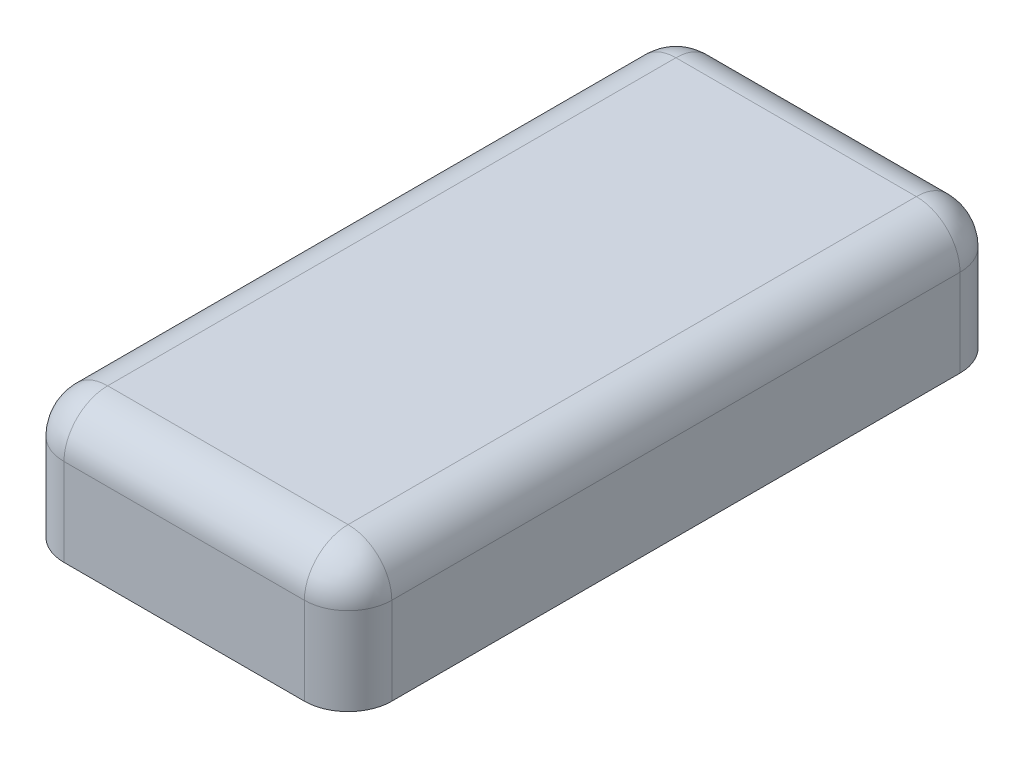
ISO-10303-21;
HEADER;
FILE_DESCRIPTION(('STEP AP214'),'2;1');
FILE_NAME('part.step','',(''),(''),'','','');
FILE_SCHEMA(('AUTOMOTIVE_DESIGN { 1 0 10303 214 1 1 1 1 }'));
ENDSEC;
DATA;
#1=APPLICATION_CONTEXT('core data for automotive mechanical design processes');
#2=APPLICATION_PROTOCOL_DEFINITION('international standard','automotive_design',2000,#1);
#3=PRODUCT_CONTEXT('',#1,'mechanical');
#4=PRODUCT('Part','Part','',(#3));
#5=PRODUCT_RELATED_PRODUCT_CATEGORY('part','',(#4));
#6=PRODUCT_DEFINITION_FORMATION('','',#4);
#7=PRODUCT_DEFINITION_CONTEXT('part definition',#1,'design');
#8=PRODUCT_DEFINITION('design','',#6,#7);
#9=PRODUCT_DEFINITION_SHAPE('','',#8);
#10=(LENGTH_UNIT() NAMED_UNIT(*) SI_UNIT(.MILLI.,.METRE.));
#11=(NAMED_UNIT(*) PLANE_ANGLE_UNIT() SI_UNIT($,.RADIAN.));
#12=(NAMED_UNIT(*) SI_UNIT($,.STERADIAN.) SOLID_ANGLE_UNIT());
#13=UNCERTAINTY_MEASURE_WITH_UNIT(LENGTH_MEASURE(1.E-05),#10,'distance_accuracy_value','');
#14=(GEOMETRIC_REPRESENTATION_CONTEXT(3) GLOBAL_UNCERTAINTY_ASSIGNED_CONTEXT((#13)) GLOBAL_UNIT_ASSIGNED_CONTEXT((#10,
#11,#12)) REPRESENTATION_CONTEXT('',''));
#15=CARTESIAN_POINT('',(0.,0.,0.));
#16=DIRECTION('',(0.,0.,1.));
#17=DIRECTION('',(1.,0.,0.));
#18=AXIS2_PLACEMENT_3D('',#15,#16,#17);
#19=CARTESIAN_POINT('',(0.75,0.6,-1.5));
#20=DIRECTION('',(-1.,0.,0.));
#21=DIRECTION('',(0.,0.,1.));
#22=AXIS2_PLACEMENT_3D('',#19,#20,#21);
#23=PLANE('',#22);
#24=DIRECTION('',(0.,-1.,0.));
#25=VECTOR('',#24,1.);
#26=CARTESIAN_POINT('',(0.75,0.6,-1.3));
#27=LINE('',#26,#25);
#28=CARTESIAN_POINT('',(0.75,0.,-1.3));
#29=VERTEX_POINT('',#28);
#30=CARTESIAN_POINT('',(0.75,0.4,-1.3));
#31=VERTEX_POINT('',#30);
#32=EDGE_CURVE('E120',#29,#31,#27,.F.);
#33=ORIENTED_EDGE('',*,*,#32,.T.);
#34=DIRECTION('',(0.,0.,-1.));
#35=VECTOR('',#34,1.);
#36=CARTESIAN_POINT('',(0.75,0.4,1.3));
#37=LINE('',#36,#35);
#38=CARTESIAN_POINT('',(0.75,0.4,1.3));
#39=VERTEX_POINT('',#38);
#40=EDGE_CURVE('E60',#31,#39,#37,.F.);
#41=ORIENTED_EDGE('',*,*,#40,.T.);
#42=DIRECTION('',(0.,-1.,0.));
#43=VECTOR('',#42,1.);
#44=CARTESIAN_POINT('',(0.75,0.6,1.3));
#45=LINE('',#44,#43);
#46=CARTESIAN_POINT('',(0.75,0.,1.3));
#47=VERTEX_POINT('',#46);
#48=EDGE_CURVE('E113',#39,#47,#45,.T.);
#49=ORIENTED_EDGE('',*,*,#48,.T.);
#50=DIRECTION('',(0.,0.,-1.));
#51=VECTOR('',#50,1.);
#52=CARTESIAN_POINT('',(0.75,0.,-1.5));
#53=LINE('',#52,#51);
#54=EDGE_CURVE('E116',#47,#29,#53,.T.);
#55=ORIENTED_EDGE('',*,*,#54,.T.);
#56=EDGE_LOOP('',(#33,#41,#49,#55));
#57=FACE_BOUND('',#56,.T.);
#58=ADVANCED_FACE('F36',(#57),#23,.F.);
#59=CARTESIAN_POINT('',(-0.75,0.6,-1.5));
#60=DIRECTION('',(0.,0.,1.));
#61=DIRECTION('',(1.,0.,0.));
#62=AXIS2_PLACEMENT_3D('',#59,#60,#61);
#63=PLANE('',#62);
#64=DIRECTION('',(0.,-1.,0.));
#65=VECTOR('',#64,1.);
#66=CARTESIAN_POINT('',(-0.55,0.6,-1.5));
#67=LINE('',#66,#65);
#68=CARTESIAN_POINT('',(-0.55,0.,-1.5));
#69=VERTEX_POINT('',#68);
#70=CARTESIAN_POINT('',(-0.55,0.4,-1.5));
#71=VERTEX_POINT('',#70);
#72=EDGE_CURVE('E153',#69,#71,#67,.F.);
#73=ORIENTED_EDGE('',*,*,#72,.T.);
#74=DIRECTION('',(-1.,0.,0.));
#75=VECTOR('',#74,1.);
#76=CARTESIAN_POINT('',(0.55,0.4,-1.5));
#77=LINE('',#76,#75);
#78=CARTESIAN_POINT('',(0.55,0.4,-1.5));
#79=VERTEX_POINT('',#78);
#80=EDGE_CURVE('E179',#71,#79,#77,.F.);
#81=ORIENTED_EDGE('',*,*,#80,.T.);
#82=DIRECTION('',(0.,-1.,0.));
#83=VECTOR('',#82,1.);
#84=CARTESIAN_POINT('',(0.55,0.6,-1.5));
#85=LINE('',#84,#83);
#86=CARTESIAN_POINT('',(0.55,0.,-1.5));
#87=VERTEX_POINT('',#86);
#88=EDGE_CURVE('E156',#79,#87,#85,.T.);
#89=ORIENTED_EDGE('',*,*,#88,.T.);
#90=DIRECTION('',(-1.,0.,0.));
#91=VECTOR('',#90,1.);
#92=CARTESIAN_POINT('',(-0.75,0.,-1.5));
#93=LINE('',#92,#91);
#94=EDGE_CURVE('E134',#87,#69,#93,.T.);
#95=ORIENTED_EDGE('',*,*,#94,.T.);
#96=EDGE_LOOP('',(#73,#81,#89,#95));
#97=FACE_BOUND('',#96,.T.);
#98=ADVANCED_FACE('F238',(#97),#63,.F.);
#99=CARTESIAN_POINT('',(-0.75,0.6,-1.5));
#100=DIRECTION('',(1.,0.,0.));
#101=DIRECTION('',(0.,0.,-1.));
#102=AXIS2_PLACEMENT_3D('',#99,#100,#101);
#103=PLANE('',#102);
#104=DIRECTION('',(0.,-1.,0.));
#105=VECTOR('',#104,1.);
#106=CARTESIAN_POINT('',(-0.75,0.6,1.3));
#107=LINE('',#106,#105);
#108=CARTESIAN_POINT('',(-0.75,0.,1.3));
#109=VERTEX_POINT('',#108);
#110=CARTESIAN_POINT('',(-0.75,0.4,1.3));
#111=VERTEX_POINT('',#110);
#112=EDGE_CURVE('E160',#109,#111,#107,.F.);
#113=ORIENTED_EDGE('',*,*,#112,.T.);
#114=DIRECTION('',(0.,0.,1.));
#115=VECTOR('',#114,1.);
#116=CARTESIAN_POINT('',(-0.75,0.4,-1.3));
#117=LINE('',#116,#115);
#118=CARTESIAN_POINT('',(-0.75,0.4,-1.3));
#119=VERTEX_POINT('',#118);
#120=EDGE_CURVE('E175',#111,#119,#117,.F.);
#121=ORIENTED_EDGE('',*,*,#120,.T.);
#122=DIRECTION('',(0.,-1.,0.));
#123=VECTOR('',#122,1.);
#124=CARTESIAN_POINT('',(-0.75,0.6,-1.3));
#125=LINE('',#124,#123);
#126=CARTESIAN_POINT('',(-0.75,0.,-1.3));
#127=VERTEX_POINT('',#126);
#128=EDGE_CURVE('E158',#119,#127,#125,.T.);
#129=ORIENTED_EDGE('',*,*,#128,.T.);
#130=DIRECTION('',(0.,0.,1.));
#131=VECTOR('',#130,1.);
#132=CARTESIAN_POINT('',(-0.75,0.,-1.5));
#133=LINE('',#132,#131);
#134=EDGE_CURVE('E137',#127,#109,#133,.T.);
#135=ORIENTED_EDGE('',*,*,#134,.T.);
#136=EDGE_LOOP('',(#113,#121,#129,#135));
#137=FACE_BOUND('',#136,.T.);
#138=ADVANCED_FACE('F243',(#137),#103,.F.);
#139=CARTESIAN_POINT('',(-0.75,0.6,1.5));
#140=DIRECTION('',(0.,0.,-1.));
#141=DIRECTION('',(-1.,0.,0.));
#142=AXIS2_PLACEMENT_3D('',#139,#140,#141);
#143=PLANE('',#142);
#144=DIRECTION('',(0.,-1.,0.));
#145=VECTOR('',#144,1.);
#146=CARTESIAN_POINT('',(0.55,0.6,1.5));
#147=LINE('',#146,#145);
#148=CARTESIAN_POINT('',(0.55,0.,1.5));
#149=VERTEX_POINT('',#148);
#150=CARTESIAN_POINT('',(0.55,0.4,1.5));
#151=VERTEX_POINT('',#150);
#152=EDGE_CURVE('E124',#149,#151,#147,.F.);
#153=ORIENTED_EDGE('',*,*,#152,.T.);
#154=DIRECTION('',(1.,0.,0.));
#155=VECTOR('',#154,1.);
#156=CARTESIAN_POINT('',(-0.55,0.4,1.5));
#157=LINE('',#156,#155);
#158=CARTESIAN_POINT('',(-0.55,0.4,1.5));
#159=VERTEX_POINT('',#158);
#160=EDGE_CURVE('E11',#151,#159,#157,.F.);
#161=ORIENTED_EDGE('',*,*,#160,.T.);
#162=DIRECTION('',(0.,-1.,0.));
#163=VECTOR('',#162,1.);
#164=CARTESIAN_POINT('',(-0.55,0.6,1.5));
#165=LINE('',#164,#163);
#166=CARTESIAN_POINT('',(-0.55,0.,1.5));
#167=VERTEX_POINT('',#166);
#168=EDGE_CURVE('E128',#159,#167,#165,.T.);
#169=ORIENTED_EDGE('',*,*,#168,.T.);
#170=DIRECTION('',(1.,0.,0.));
#171=VECTOR('',#170,1.);
#172=CARTESIAN_POINT('',(-0.75,0.,1.5));
#173=LINE('',#172,#171);
#174=EDGE_CURVE('E144',#167,#149,#173,.T.);
#175=ORIENTED_EDGE('',*,*,#174,.T.);
#176=EDGE_LOOP('',(#153,#161,#169,#175));
#177=FACE_BOUND('',#176,.T.);
#178=ADVANCED_FACE('F354',(#177),#143,.F.);
#179=CARTESIAN_POINT('',(0.,0.6,0.));
#180=DIRECTION('',(0.,1.,0.));
#181=DIRECTION('',(0.,0.,1.));
#182=AXIS2_PLACEMENT_3D('',#179,#180,#181);
#183=PLANE('',#182);
#184=DIRECTION('',(-1.,0.,0.));
#185=VECTOR('',#184,1.);
#186=CARTESIAN_POINT('',(-0.55,0.6,-1.3));
#187=LINE('',#186,#185);
#188=CARTESIAN_POINT('',(0.55,0.6,-1.3));
#189=VERTEX_POINT('',#188);
#190=CARTESIAN_POINT('',(-0.55,0.6,-1.3));
#191=VERTEX_POINT('',#190);
#192=EDGE_CURVE('E170',#189,#191,#187,.T.);
#193=ORIENTED_EDGE('',*,*,#192,.T.);
#194=DIRECTION('',(0.,0.,1.));
#195=VECTOR('',#194,1.);
#196=CARTESIAN_POINT('',(-0.55,0.6,1.3));
#197=LINE('',#196,#195);
#198=CARTESIAN_POINT('',(-0.55,0.6,1.3));
#199=VERTEX_POINT('',#198);
#200=EDGE_CURVE('E172',#191,#199,#197,.T.);
#201=ORIENTED_EDGE('',*,*,#200,.T.);
#202=DIRECTION('',(1.,0.,0.));
#203=VECTOR('',#202,1.);
#204=CARTESIAN_POINT('',(0.55,0.6,1.3));
#205=LINE('',#204,#203);
#206=CARTESIAN_POINT('',(0.55,0.6,1.3));
#207=VERTEX_POINT('',#206);
#208=EDGE_CURVE('E166',#199,#207,#205,.T.);
#209=ORIENTED_EDGE('',*,*,#208,.T.);
#210=DIRECTION('',(0.,0.,-1.));
#211=VECTOR('',#210,1.);
#212=CARTESIAN_POINT('',(0.55,0.6,-1.3));
#213=LINE('',#212,#211);
#214=EDGE_CURVE('E168',#207,#189,#213,.T.);
#215=ORIENTED_EDGE('',*,*,#214,.T.);
#216=EDGE_LOOP('',(#193,#201,#209,#215));
#217=FACE_BOUND('',#216,.T.);
#218=ADVANCED_FACE('F215',(#217),#183,.T.);
#219=CARTESIAN_POINT('',(0.,0.,0.));
#220=DIRECTION('',(0.,1.,0.));
#221=DIRECTION('',(0.,0.,1.));
#222=AXIS2_PLACEMENT_3D('',#219,#220,#221);
#223=PLANE('',#222);
#224=ORIENTED_EDGE('',*,*,#54,.F.);
#225=CARTESIAN_POINT('',(0.55,0.,1.3));
#226=DIRECTION('',(0.,1.,0.));
#227=DIRECTION('',(0.,0.,1.));
#228=AXIS2_PLACEMENT_3D('',#225,#226,#227);
#229=CIRCLE('',#228,0.2);
#230=EDGE_CURVE('E122',#47,#149,#229,.F.);
#231=ORIENTED_EDGE('',*,*,#230,.T.);
#232=ORIENTED_EDGE('',*,*,#174,.F.);
#233=CARTESIAN_POINT('',(-0.55,0.,1.3));
#234=DIRECTION('',(0.,1.,0.));
#235=DIRECTION('',(0.,0.,1.));
#236=AXIS2_PLACEMENT_3D('',#233,#234,#235);
#237=CIRCLE('',#236,0.2);
#238=EDGE_CURVE('E148',#167,#109,#237,.F.);
#239=ORIENTED_EDGE('',*,*,#238,.T.);
#240=ORIENTED_EDGE('',*,*,#134,.F.);
#241=CARTESIAN_POINT('',(-0.55,0.,-1.3));
#242=DIRECTION('',(0.,1.,0.));
#243=DIRECTION('',(0.,0.,1.));
#244=AXIS2_PLACEMENT_3D('',#241,#242,#243);
#245=CIRCLE('',#244,0.2);
#246=EDGE_CURVE('E119',#127,#69,#245,.F.);
#247=ORIENTED_EDGE('',*,*,#246,.T.);
#248=ORIENTED_EDGE('',*,*,#94,.F.);
#249=CARTESIAN_POINT('',(0.55,0.,-1.3));
#250=DIRECTION('',(0.,1.,0.));
#251=DIRECTION('',(0.,0.,1.));
#252=AXIS2_PLACEMENT_3D('',#249,#250,#251);
#253=CIRCLE('',#252,0.2);
#254=EDGE_CURVE('E129',#87,#29,#253,.F.);
#255=ORIENTED_EDGE('',*,*,#254,.T.);
#256=EDGE_LOOP('',(#224,#231,#232,#239,#240,#247,#248,#255));
#257=FACE_BOUND('',#256,.T.);
#258=ADVANCED_FACE('F131',(#257),#223,.F.);
#259=CARTESIAN_POINT('',(0.55,0.6,1.3));
#260=DIRECTION('',(0.,-1.,0.));
#261=DIRECTION('',(0.,0.,-1.));
#262=AXIS2_PLACEMENT_3D('',#259,#260,#261);
#263=CYLINDRICAL_SURFACE('',#262,0.2);
#264=ORIENTED_EDGE('',*,*,#48,.F.);
#265=CARTESIAN_POINT('',(0.55,0.4,1.3));
#266=DIRECTION('',(0.,-1.,0.));
#267=DIRECTION('',(0.,0.,-1.));
#268=AXIS2_PLACEMENT_3D('',#265,#266,#267);
#269=CIRCLE('',#268,0.2);
#270=EDGE_CURVE('E45',#39,#151,#269,.T.);
#271=ORIENTED_EDGE('',*,*,#270,.T.);
#272=ORIENTED_EDGE('',*,*,#152,.F.);
#273=ORIENTED_EDGE('',*,*,#230,.F.);
#274=EDGE_LOOP('',(#264,#271,#272,#273));
#275=FACE_BOUND('',#274,.T.);
#276=ADVANCED_FACE('F123',(#275),#263,.T.);
#277=CARTESIAN_POINT('',(0.55,0.6,-1.3));
#278=DIRECTION('',(0.,-1.,0.));
#279=DIRECTION('',(0.,0.,-1.));
#280=AXIS2_PLACEMENT_3D('',#277,#278,#279);
#281=CYLINDRICAL_SURFACE('',#280,0.2);
#282=ORIENTED_EDGE('',*,*,#88,.F.);
#283=CARTESIAN_POINT('',(0.55,0.4,-1.3));
#284=DIRECTION('',(0.,-1.,0.));
#285=DIRECTION('',(0.,0.,-1.));
#286=AXIS2_PLACEMENT_3D('',#283,#284,#285);
#287=CIRCLE('',#286,0.2);
#288=EDGE_CURVE('E181',#79,#31,#287,.T.);
#289=ORIENTED_EDGE('',*,*,#288,.T.);
#290=ORIENTED_EDGE('',*,*,#32,.F.);
#291=ORIENTED_EDGE('',*,*,#254,.F.);
#292=EDGE_LOOP('',(#282,#289,#290,#291));
#293=FACE_BOUND('',#292,.T.);
#294=ADVANCED_FACE('F250',(#293),#281,.T.);
#295=CARTESIAN_POINT('',(-0.55,0.6,1.3));
#296=DIRECTION('',(0.,-1.,0.));
#297=DIRECTION('',(0.,0.,-1.));
#298=AXIS2_PLACEMENT_3D('',#295,#296,#297);
#299=CYLINDRICAL_SURFACE('',#298,0.2);
#300=ORIENTED_EDGE('',*,*,#168,.F.);
#301=CARTESIAN_POINT('',(-0.55,0.4,1.3));
#302=DIRECTION('',(0.,-1.,0.));
#303=DIRECTION('',(0.,0.,-1.));
#304=AXIS2_PLACEMENT_3D('',#301,#302,#303);
#305=CIRCLE('',#304,0.2);
#306=EDGE_CURVE('E163',#159,#111,#305,.T.);
#307=ORIENTED_EDGE('',*,*,#306,.T.);
#308=ORIENTED_EDGE('',*,*,#112,.F.);
#309=ORIENTED_EDGE('',*,*,#238,.F.);
#310=EDGE_LOOP('',(#300,#307,#308,#309));
#311=FACE_BOUND('',#310,.T.);
#312=ADVANCED_FACE('F253',(#311),#299,.T.);
#313=CARTESIAN_POINT('',(-0.55,0.6,-1.3));
#314=DIRECTION('',(0.,-1.,0.));
#315=DIRECTION('',(0.,0.,-1.));
#316=AXIS2_PLACEMENT_3D('',#313,#314,#315);
#317=CYLINDRICAL_SURFACE('',#316,0.2);
#318=ORIENTED_EDGE('',*,*,#128,.F.);
#319=CARTESIAN_POINT('',(-0.55,0.4,-1.3));
#320=DIRECTION('',(0.,-1.,0.));
#321=DIRECTION('',(0.,0.,-1.));
#322=AXIS2_PLACEMENT_3D('',#319,#320,#321);
#323=CIRCLE('',#322,0.2);
#324=EDGE_CURVE('E177',#119,#71,#323,.T.);
#325=ORIENTED_EDGE('',*,*,#324,.T.);
#326=ORIENTED_EDGE('',*,*,#72,.F.);
#327=ORIENTED_EDGE('',*,*,#246,.F.);
#328=EDGE_LOOP('',(#318,#325,#326,#327));
#329=FACE_BOUND('',#328,.T.);
#330=ADVANCED_FACE('F257',(#329),#317,.T.);
#331=CARTESIAN_POINT('',(0.55,0.4,-1.3));
#332=DIRECTION('',(0.,1.,0.));
#333=DIRECTION('',(0.,0.,1.));
#334=AXIS2_PLACEMENT_3D('',#331,#332,#333);
#335=SPHERICAL_SURFACE('',#334,0.2);
#336=CARTESIAN_POINT('',(0.55,0.4,-1.3));
#337=DIRECTION('',(0.,0.,1.));
#338=DIRECTION('',(1.,0.,0.));
#339=AXIS2_PLACEMENT_3D('',#336,#337,#338);
#340=CIRCLE('',#339,0.2);
#341=EDGE_CURVE('E140',#31,#189,#340,.T.);
#342=ORIENTED_EDGE('',*,*,#341,.F.);
#343=ORIENTED_EDGE('',*,*,#288,.F.);
#344=CARTESIAN_POINT('',(0.55,0.4,-1.3));
#345=DIRECTION('',(-1.,0.,0.));
#346=DIRECTION('',(0.,0.,1.));
#347=AXIS2_PLACEMENT_3D('',#344,#345,#346);
#348=CIRCLE('',#347,0.2);
#349=EDGE_CURVE('E40',#189,#79,#348,.T.);
#350=ORIENTED_EDGE('',*,*,#349,.F.);
#351=EDGE_LOOP('',(#342,#343,#350));
#352=FACE_BOUND('',#351,.T.);
#353=ADVANCED_FACE('F38',(#352),#335,.T.);
#354=CARTESIAN_POINT('',(0.,0.4,-1.3));
#355=DIRECTION('',(1.,0.,0.));
#356=DIRECTION('',(0.,0.,-1.));
#357=AXIS2_PLACEMENT_3D('',#354,#355,#356);
#358=CYLINDRICAL_SURFACE('',#357,0.2);
#359=ORIENTED_EDGE('',*,*,#349,.T.);
#360=ORIENTED_EDGE('',*,*,#80,.F.);
#361=CARTESIAN_POINT('',(-0.55,0.4,-1.3));
#362=DIRECTION('',(-1.,0.,0.));
#363=DIRECTION('',(0.,0.,1.));
#364=AXIS2_PLACEMENT_3D('',#361,#362,#363);
#365=CIRCLE('',#364,0.2);
#366=EDGE_CURVE('E198',#191,#71,#365,.T.);
#367=ORIENTED_EDGE('',*,*,#366,.F.);
#368=ORIENTED_EDGE('',*,*,#192,.F.);
#369=EDGE_LOOP('',(#359,#360,#367,#368));
#370=FACE_BOUND('',#369,.T.);
#371=ADVANCED_FACE('F212',(#370),#358,.T.);
#372=CARTESIAN_POINT('',(0.55,0.4,0.));
#373=DIRECTION('',(0.,0.,1.));
#374=DIRECTION('',(1.,0.,0.));
#375=AXIS2_PLACEMENT_3D('',#372,#373,#374);
#376=CYLINDRICAL_SURFACE('',#375,0.2);
#377=ORIENTED_EDGE('',*,*,#341,.T.);
#378=ORIENTED_EDGE('',*,*,#214,.F.);
#379=CARTESIAN_POINT('',(0.55,0.4,1.3));
#380=DIRECTION('',(0.,0.,1.));
#381=DIRECTION('',(1.,0.,0.));
#382=AXIS2_PLACEMENT_3D('',#379,#380,#381);
#383=CIRCLE('',#382,0.2);
#384=EDGE_CURVE('E195',#39,#207,#383,.T.);
#385=ORIENTED_EDGE('',*,*,#384,.F.);
#386=ORIENTED_EDGE('',*,*,#40,.F.);
#387=EDGE_LOOP('',(#377,#378,#385,#386));
#388=FACE_BOUND('',#387,.T.);
#389=ADVANCED_FACE('F205',(#388),#376,.T.);
#390=CARTESIAN_POINT('',(-0.55,0.4,-1.3));
#391=DIRECTION('',(0.,1.,0.));
#392=DIRECTION('',(0.,0.,1.));
#393=AXIS2_PLACEMENT_3D('',#390,#391,#392);
#394=SPHERICAL_SURFACE('',#393,0.2);
#395=ORIENTED_EDGE('',*,*,#366,.T.);
#396=ORIENTED_EDGE('',*,*,#324,.F.);
#397=CARTESIAN_POINT('',(-0.55,0.4,-1.3));
#398=DIRECTION('',(0.,0.,1.));
#399=DIRECTION('',(1.,0.,0.));
#400=AXIS2_PLACEMENT_3D('',#397,#398,#399);
#401=CIRCLE('',#400,0.2);
#402=EDGE_CURVE('E192',#191,#119,#401,.T.);
#403=ORIENTED_EDGE('',*,*,#402,.F.);
#404=EDGE_LOOP('',(#395,#396,#403));
#405=FACE_BOUND('',#404,.T.);
#406=ADVANCED_FACE('F227',(#405),#394,.T.);
#407=CARTESIAN_POINT('',(0.55,0.4,1.3));
#408=DIRECTION('',(0.,1.,0.));
#409=DIRECTION('',(0.,0.,1.));
#410=AXIS2_PLACEMENT_3D('',#407,#408,#409);
#411=SPHERICAL_SURFACE('',#410,0.2);
#412=ORIENTED_EDGE('',*,*,#270,.F.);
#413=ORIENTED_EDGE('',*,*,#384,.T.);
#414=CARTESIAN_POINT('',(0.55,0.4,1.3));
#415=DIRECTION('',(-1.,0.,0.));
#416=DIRECTION('',(0.,0.,1.));
#417=AXIS2_PLACEMENT_3D('',#414,#415,#416);
#418=CIRCLE('',#417,0.2);
#419=EDGE_CURVE('E189',#151,#207,#418,.T.);
#420=ORIENTED_EDGE('',*,*,#419,.F.);
#421=EDGE_LOOP('',(#412,#413,#420));
#422=FACE_BOUND('',#421,.T.);
#423=ADVANCED_FACE('F224',(#422),#411,.T.);
#424=CARTESIAN_POINT('',(-0.55,0.4,0.));
#425=DIRECTION('',(0.,0.,-1.));
#426=DIRECTION('',(-1.,0.,0.));
#427=AXIS2_PLACEMENT_3D('',#424,#425,#426);
#428=CYLINDRICAL_SURFACE('',#427,0.2);
#429=ORIENTED_EDGE('',*,*,#402,.T.);
#430=ORIENTED_EDGE('',*,*,#120,.F.);
#431=CARTESIAN_POINT('',(-0.55,0.4,1.3));
#432=DIRECTION('',(0.,0.,1.));
#433=DIRECTION('',(1.,0.,0.));
#434=AXIS2_PLACEMENT_3D('',#431,#432,#433);
#435=CIRCLE('',#434,0.2);
#436=EDGE_CURVE('E187',#199,#111,#435,.T.);
#437=ORIENTED_EDGE('',*,*,#436,.F.);
#438=ORIENTED_EDGE('',*,*,#200,.F.);
#439=EDGE_LOOP('',(#429,#430,#437,#438));
#440=FACE_BOUND('',#439,.T.);
#441=ADVANCED_FACE('F226',(#440),#428,.T.);
#442=CARTESIAN_POINT('',(0.,0.4,1.3));
#443=DIRECTION('',(-1.,0.,0.));
#444=DIRECTION('',(0.,0.,1.));
#445=AXIS2_PLACEMENT_3D('',#442,#443,#444);
#446=CYLINDRICAL_SURFACE('',#445,0.2);
#447=ORIENTED_EDGE('',*,*,#419,.T.);
#448=ORIENTED_EDGE('',*,*,#208,.F.);
#449=CARTESIAN_POINT('',(-0.55,0.4,1.3));
#450=DIRECTION('',(-1.,0.,0.));
#451=DIRECTION('',(0.,0.,1.));
#452=AXIS2_PLACEMENT_3D('',#449,#450,#451);
#453=CIRCLE('',#452,0.2);
#454=EDGE_CURVE('E185',#159,#199,#453,.T.);
#455=ORIENTED_EDGE('',*,*,#454,.F.);
#456=ORIENTED_EDGE('',*,*,#160,.F.);
#457=EDGE_LOOP('',(#447,#448,#455,#456));
#458=FACE_BOUND('',#457,.T.);
#459=ADVANCED_FACE('F220',(#458),#446,.T.);
#460=CARTESIAN_POINT('',(-0.55,0.4,1.3));
#461=DIRECTION('',(0.,1.,0.));
#462=DIRECTION('',(0.,0.,1.));
#463=AXIS2_PLACEMENT_3D('',#460,#461,#462);
#464=SPHERICAL_SURFACE('',#463,0.2);
#465=ORIENTED_EDGE('',*,*,#436,.T.);
#466=ORIENTED_EDGE('',*,*,#306,.F.);
#467=ORIENTED_EDGE('',*,*,#454,.T.);
#468=EDGE_LOOP('',(#465,#466,#467));
#469=FACE_BOUND('',#468,.T.);
#470=ADVANCED_FACE('F262',(#469),#464,.T.);
#471=CLOSED_SHELL('',(#58,#98,#138,#178,#218,#258,#276,#294,#312,#330,#353,#371,#389,#406,#423,
#441,#459,#470));
#472=MANIFOLD_SOLID_BREP('B2',#471);
#473=ADVANCED_BREP_SHAPE_REPRESENTATION('',(#18,#472),#14);
#474=SHAPE_DEFINITION_REPRESENTATION(#9,#473);
ENDSEC;
END-ISO-10303-21;
